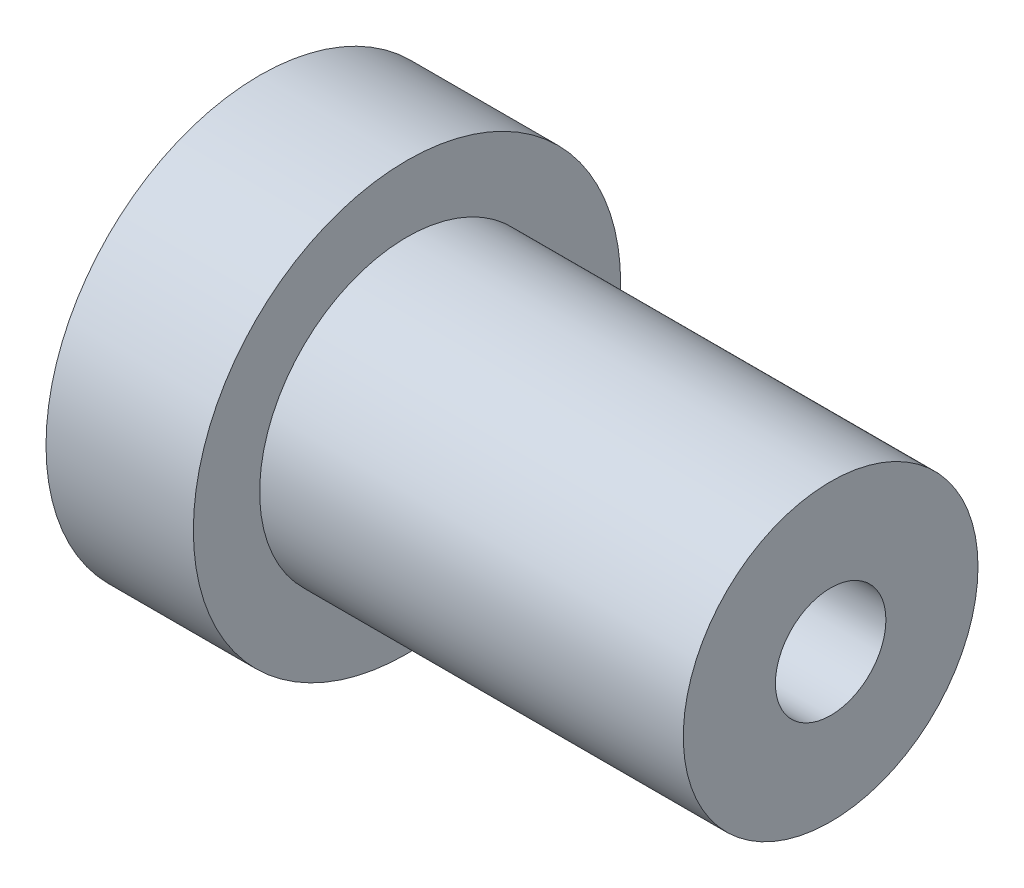
ISO-10303-21;
HEADER;
FILE_DESCRIPTION(('STEP AP214'),'2;1');
FILE_NAME('part.step','',(''),(''),'','','');
FILE_SCHEMA(('AUTOMOTIVE_DESIGN { 1 0 10303 214 1 1 1 1 }'));
ENDSEC;
DATA;
#1=APPLICATION_CONTEXT('core data for automotive mechanical design processes');
#2=APPLICATION_PROTOCOL_DEFINITION('international standard','automotive_design',2000,#1);
#3=PRODUCT_CONTEXT('',#1,'mechanical');
#4=PRODUCT('Part','Part','',(#3));
#5=PRODUCT_RELATED_PRODUCT_CATEGORY('part','',(#4));
#6=PRODUCT_DEFINITION_FORMATION('','',#4);
#7=PRODUCT_DEFINITION_CONTEXT('part definition',#1,'design');
#8=PRODUCT_DEFINITION('design','',#6,#7);
#9=PRODUCT_DEFINITION_SHAPE('','',#8);
#10=(LENGTH_UNIT() NAMED_UNIT(*) SI_UNIT(.MILLI.,.METRE.));
#11=(NAMED_UNIT(*) PLANE_ANGLE_UNIT() SI_UNIT($,.RADIAN.));
#12=(NAMED_UNIT(*) SI_UNIT($,.STERADIAN.) SOLID_ANGLE_UNIT());
#13=UNCERTAINTY_MEASURE_WITH_UNIT(LENGTH_MEASURE(1.E-05),#10,'distance_accuracy_value','');
#14=(GEOMETRIC_REPRESENTATION_CONTEXT(3) GLOBAL_UNCERTAINTY_ASSIGNED_CONTEXT((#13)) GLOBAL_UNIT_ASSIGNED_CONTEXT((#10,
#11,#12)) REPRESENTATION_CONTEXT('',''));
#15=CARTESIAN_POINT('',(0.,0.,0.));
#16=DIRECTION('',(0.,0.,1.));
#17=DIRECTION('',(1.,0.,0.));
#18=AXIS2_PLACEMENT_3D('',#15,#16,#17);
#19=CARTESIAN_POINT('',(20.,0.,0.));
#20=DIRECTION('',(-1.,0.,0.));
#21=DIRECTION('',(0.,0.,1.));
#22=AXIS2_PLACEMENT_3D('',#19,#20,#21);
#23=CYLINDRICAL_SURFACE('',#22,1.5);
#24=CARTESIAN_POINT('',(15.5,0.,0.));
#25=DIRECTION('',(1.,0.,0.));
#26=DIRECTION('',(0.,0.,-1.));
#27=AXIS2_PLACEMENT_3D('',#24,#25,#26);
#28=CIRCLE('',#27,1.5);
#29=CARTESIAN_POINT('',(15.5,0.,-1.5));
#30=VERTEX_POINT('',#29);
#31=EDGE_CURVE('E55',#30,#30,#28,.T.);
#32=ORIENTED_EDGE('',*,*,#31,.T.);
#33=EDGE_LOOP('',(#32));
#34=FACE_BOUND('',#33,.T.);
#35=CARTESIAN_POINT('',(3.,0.,0.));
#36=DIRECTION('',(-1.,0.,0.));
#37=DIRECTION('',(0.,0.,1.));
#38=AXIS2_PLACEMENT_3D('',#35,#36,#37);
#39=CIRCLE('',#38,1.5);
#40=CARTESIAN_POINT('',(3.,0.,1.5));
#41=VERTEX_POINT('',#40);
#42=EDGE_CURVE('E39',#41,#41,#39,.F.);
#43=ORIENTED_EDGE('',*,*,#42,.F.);
#44=EDGE_LOOP('',(#43));
#45=FACE_BOUND('',#44,.T.);
#46=ADVANCED_FACE('F35',(#34,#45),#23,.F.);
#47=CARTESIAN_POINT('',(4.,0.,0.));
#48=DIRECTION('',(-1.,0.,0.));
#49=DIRECTION('',(0.,0.,1.));
#50=AXIS2_PLACEMENT_3D('',#47,#48,#49);
#51=CYLINDRICAL_SURFACE('',#50,5.8);
#52=CARTESIAN_POINT('',(4.,0.,0.));
#53=DIRECTION('',(1.,0.,0.));
#54=DIRECTION('',(0.,0.,-1.));
#55=AXIS2_PLACEMENT_3D('',#52,#53,#54);
#56=CIRCLE('',#55,5.8);
#57=CARTESIAN_POINT('',(4.,0.,-5.8));
#58=VERTEX_POINT('',#57);
#59=EDGE_CURVE('E43',#58,#58,#56,.T.);
#60=ORIENTED_EDGE('',*,*,#59,.F.);
#61=EDGE_LOOP('',(#60));
#62=FACE_BOUND('',#61,.T.);
#63=CARTESIAN_POINT('',(0.,0.,0.));
#64=DIRECTION('',(1.,0.,0.));
#65=DIRECTION('',(0.,0.,-1.));
#66=AXIS2_PLACEMENT_3D('',#63,#64,#65);
#67=CIRCLE('',#66,5.8);
#68=CARTESIAN_POINT('',(0.,0.,-5.8));
#69=VERTEX_POINT('',#68);
#70=EDGE_CURVE('E48',#69,#69,#67,.T.);
#71=ORIENTED_EDGE('',*,*,#70,.T.);
#72=EDGE_LOOP('',(#71));
#73=FACE_BOUND('',#72,.T.);
#74=ADVANCED_FACE('F37',(#62,#73),#51,.T.);
#75=CARTESIAN_POINT('',(4.,0.,0.));
#76=DIRECTION('',(1.,0.,0.));
#77=DIRECTION('',(0.,0.,-1.));
#78=AXIS2_PLACEMENT_3D('',#75,#76,#77);
#79=PLANE('',#78);
#80=CARTESIAN_POINT('',(4.,0.,0.));
#81=DIRECTION('',(1.,0.,0.));
#82=DIRECTION('',(0.,0.,-1.));
#83=AXIS2_PLACEMENT_3D('',#80,#81,#82);
#84=CIRCLE('',#83,4.);
#85=CARTESIAN_POINT('',(4.,0.,-4.));
#86=VERTEX_POINT('',#85);
#87=EDGE_CURVE('E10',#86,#86,#84,.T.);
#88=ORIENTED_EDGE('',*,*,#87,.F.);
#89=EDGE_LOOP('',(#88));
#90=FACE_BOUND('',#89,.T.);
#91=ORIENTED_EDGE('',*,*,#59,.T.);
#92=EDGE_LOOP('',(#91));
#93=FACE_BOUND('',#92,.T.);
#94=ADVANCED_FACE('F78',(#90,#93),#79,.T.);
#95=CARTESIAN_POINT('',(0.,0.,0.));
#96=DIRECTION('',(1.,0.,0.));
#97=DIRECTION('',(0.,0.,-1.));
#98=AXIS2_PLACEMENT_3D('',#95,#96,#97);
#99=PLANE('',#98);
#100=CARTESIAN_POINT('',(0.,0.,0.));
#101=DIRECTION('',(-1.,0.,0.));
#102=DIRECTION('',(0.,0.,1.));
#103=AXIS2_PLACEMENT_3D('',#100,#101,#102);
#104=CIRCLE('',#103,3.);
#105=CARTESIAN_POINT('',(0.,0.,3.));
#106=VERTEX_POINT('',#105);
#107=EDGE_CURVE('E65',#106,#106,#104,.T.);
#108=ORIENTED_EDGE('',*,*,#107,.F.);
#109=EDGE_LOOP('',(#108));
#110=FACE_BOUND('',#109,.T.);
#111=ORIENTED_EDGE('',*,*,#70,.F.);
#112=EDGE_LOOP('',(#111));
#113=FACE_BOUND('',#112,.T.);
#114=ADVANCED_FACE('F74',(#110,#113),#99,.F.);
#115=CARTESIAN_POINT('',(15.5,0.,0.));
#116=DIRECTION('',(-1.,0.,0.));
#117=DIRECTION('',(0.,0.,1.));
#118=AXIS2_PLACEMENT_3D('',#115,#116,#117);
#119=CYLINDRICAL_SURFACE('',#118,4.);
#120=CARTESIAN_POINT('',(15.5,0.,0.));
#121=DIRECTION('',(1.,0.,0.));
#122=DIRECTION('',(0.,0.,-1.));
#123=AXIS2_PLACEMENT_3D('',#120,#121,#122);
#124=CIRCLE('',#123,4.);
#125=CARTESIAN_POINT('',(15.5,0.,-4.));
#126=VERTEX_POINT('',#125);
#127=EDGE_CURVE('E51',#126,#126,#124,.T.);
#128=ORIENTED_EDGE('',*,*,#127,.F.);
#129=EDGE_LOOP('',(#128));
#130=FACE_BOUND('',#129,.T.);
#131=ORIENTED_EDGE('',*,*,#87,.T.);
#132=EDGE_LOOP('',(#131));
#133=FACE_BOUND('',#132,.T.);
#134=ADVANCED_FACE('F77',(#130,#133),#119,.T.);
#135=CARTESIAN_POINT('',(15.5,0.,0.));
#136=DIRECTION('',(1.,0.,0.));
#137=DIRECTION('',(0.,0.,-1.));
#138=AXIS2_PLACEMENT_3D('',#135,#136,#137);
#139=PLANE('',#138);
#140=ORIENTED_EDGE('',*,*,#31,.F.);
#141=EDGE_LOOP('',(#140));
#142=FACE_BOUND('',#141,.T.);
#143=ORIENTED_EDGE('',*,*,#127,.T.);
#144=EDGE_LOOP('',(#143));
#145=FACE_BOUND('',#144,.T.);
#146=ADVANCED_FACE('F98',(#142,#145),#139,.T.);
#147=CARTESIAN_POINT('',(3.,0.,0.));
#148=DIRECTION('',(-1.,0.,0.));
#149=DIRECTION('',(0.,0.,1.));
#150=AXIS2_PLACEMENT_3D('',#147,#148,#149);
#151=PLANE('',#150);
#152=CARTESIAN_POINT('',(3.,0.,0.));
#153=DIRECTION('',(-1.,0.,0.));
#154=DIRECTION('',(0.,0.,1.));
#155=AXIS2_PLACEMENT_3D('',#152,#153,#154);
#156=CIRCLE('',#155,3.);
#157=CARTESIAN_POINT('',(3.,0.,3.));
#158=VERTEX_POINT('',#157);
#159=EDGE_CURVE('E61',#158,#158,#156,.T.);
#160=ORIENTED_EDGE('',*,*,#159,.T.);
#161=EDGE_LOOP('',(#160));
#162=FACE_BOUND('',#161,.T.);
#163=ORIENTED_EDGE('',*,*,#42,.T.);
#164=EDGE_LOOP('',(#163));
#165=FACE_BOUND('',#164,.T.);
#166=ADVANCED_FACE('F101',(#162,#165),#151,.T.);
#167=CARTESIAN_POINT('',(3.,0.,0.));
#168=DIRECTION('',(-1.,0.,0.));
#169=DIRECTION('',(0.,0.,1.));
#170=AXIS2_PLACEMENT_3D('',#167,#168,#169);
#171=CYLINDRICAL_SURFACE('',#170,3.);
#172=ORIENTED_EDGE('',*,*,#159,.F.);
#173=EDGE_LOOP('',(#172));
#174=FACE_BOUND('',#173,.T.);
#175=ORIENTED_EDGE('',*,*,#107,.T.);
#176=EDGE_LOOP('',(#175));
#177=FACE_BOUND('',#176,.T.);
#178=ADVANCED_FACE('F72',(#174,#177),#171,.F.);
#179=CLOSED_SHELL('',(#46,#74,#94,#114,#134,#146,#166,#178));
#180=MANIFOLD_SOLID_BREP('B2',#179);
#181=ADVANCED_BREP_SHAPE_REPRESENTATION('',(#18,#180),#14);
#182=SHAPE_DEFINITION_REPRESENTATION(#9,#181);
ENDSEC;
END-ISO-10303-21;
